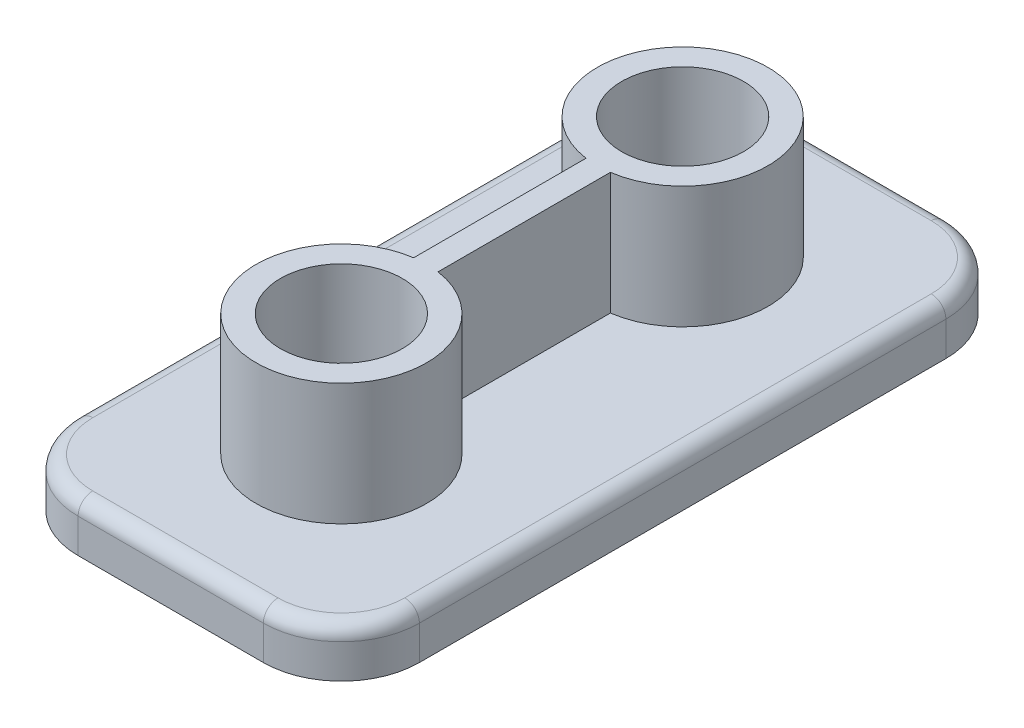
ISO-10303-21;
HEADER;
FILE_DESCRIPTION(('STEP AP214'),'2;1');
FILE_NAME('part.step','',(''),(''),'','','');
FILE_SCHEMA(('AUTOMOTIVE_DESIGN { 1 0 10303 214 1 1 1 1 }'));
ENDSEC;
DATA;
#1=APPLICATION_CONTEXT('core data for automotive mechanical design processes');
#2=APPLICATION_PROTOCOL_DEFINITION('international standard','automotive_design',2000,#1);
#3=PRODUCT_CONTEXT('',#1,'mechanical');
#4=PRODUCT('Part','Part','',(#3));
#5=PRODUCT_RELATED_PRODUCT_CATEGORY('part','',(#4));
#6=PRODUCT_DEFINITION_FORMATION('','',#4);
#7=PRODUCT_DEFINITION_CONTEXT('part definition',#1,'design');
#8=PRODUCT_DEFINITION('design','',#6,#7);
#9=PRODUCT_DEFINITION_SHAPE('','',#8);
#10=(LENGTH_UNIT() NAMED_UNIT(*) SI_UNIT(.MILLI.,.METRE.));
#11=(NAMED_UNIT(*) PLANE_ANGLE_UNIT() SI_UNIT($,.RADIAN.));
#12=(NAMED_UNIT(*) SI_UNIT($,.STERADIAN.) SOLID_ANGLE_UNIT());
#13=UNCERTAINTY_MEASURE_WITH_UNIT(LENGTH_MEASURE(1.E-05),#10,'distance_accuracy_value','');
#14=(GEOMETRIC_REPRESENTATION_CONTEXT(3) GLOBAL_UNCERTAINTY_ASSIGNED_CONTEXT((#13)) GLOBAL_UNIT_ASSIGNED_CONTEXT((#10,
#11,#12)) REPRESENTATION_CONTEXT('',''));
#15=CARTESIAN_POINT('',(0.,0.,0.));
#16=DIRECTION('',(0.,0.,1.));
#17=DIRECTION('',(1.,0.,0.));
#18=AXIS2_PLACEMENT_3D('',#15,#16,#17);
#19=CARTESIAN_POINT('',(-19.171974522293,0.,140.));
#20=DIRECTION('',(0.,-1.,0.));
#21=DIRECTION('',(0.,0.,-1.));
#22=AXIS2_PLACEMENT_3D('',#19,#20,#21);
#23=PLANE('',#22);
#24=CARTESIAN_POINT('',(34.828025477707,0.,124.));
#25=DIRECTION('',(0.,-1.,0.));
#26=DIRECTION('',(0.,0.,-1.));
#27=AXIS2_PLACEMENT_3D('',#24,#25,#26);
#28=CIRCLE('',#27,13.);
#29=CARTESIAN_POINT('',(34.828025477707,0.,137.));
#30=VERTEX_POINT('',#29);
#31=CARTESIAN_POINT('',(47.828025477707,0.,124.));
#32=VERTEX_POINT('',#31);
#33=EDGE_CURVE('E207',#30,#32,#28,.F.);
#34=ORIENTED_EDGE('',*,*,#33,.T.);
#35=DIRECTION('',(0.,0.,-1.));
#36=VECTOR('',#35,1.);
#37=CARTESIAN_POINT('',(47.828025477707,0.,140.));
#38=LINE('',#37,#36);
#39=CARTESIAN_POINT('',(47.828025477707,0.,16.));
#40=VERTEX_POINT('',#39);
#41=EDGE_CURVE('E221',#32,#40,#38,.T.);
#42=ORIENTED_EDGE('',*,*,#41,.T.);
#43=CARTESIAN_POINT('',(34.828025477707,0.,16.));
#44=DIRECTION('',(0.,-1.,0.));
#45=DIRECTION('',(0.,0.,-1.));
#46=AXIS2_PLACEMENT_3D('',#43,#44,#45);
#47=CIRCLE('',#46,13.);
#48=CARTESIAN_POINT('',(34.828025477707,0.,3.));
#49=VERTEX_POINT('',#48);
#50=EDGE_CURVE('E219',#40,#49,#47,.F.);
#51=ORIENTED_EDGE('',*,*,#50,.T.);
#52=DIRECTION('',(-1.,0.,0.));
#53=VECTOR('',#52,1.);
#54=CARTESIAN_POINT('',(-19.171974522293,0.,3.));
#55=LINE('',#54,#53);
#56=CARTESIAN_POINT('',(-3.17197452229299,0.,3.));
#57=VERTEX_POINT('',#56);
#58=EDGE_CURVE('E217',#49,#57,#55,.T.);
#59=ORIENTED_EDGE('',*,*,#58,.T.);
#60=CARTESIAN_POINT('',(-3.17197452229299,0.,16.));
#61=DIRECTION('',(0.,-1.,0.));
#62=DIRECTION('',(0.,0.,-1.));
#63=AXIS2_PLACEMENT_3D('',#60,#61,#62);
#64=CIRCLE('',#63,13.);
#65=CARTESIAN_POINT('',(-16.171974522293,0.,16.));
#66=VERTEX_POINT('',#65);
#67=EDGE_CURVE('E215',#57,#66,#64,.F.);
#68=ORIENTED_EDGE('',*,*,#67,.T.);
#69=DIRECTION('',(0.,0.,-1.));
#70=VECTOR('',#69,1.);
#71=CARTESIAN_POINT('',(-16.171974522293,0.,140.));
#72=LINE('',#71,#70);
#73=CARTESIAN_POINT('',(-16.171974522293,0.,124.));
#74=VERTEX_POINT('',#73);
#75=EDGE_CURVE('E213',#66,#74,#72,.F.);
#76=ORIENTED_EDGE('',*,*,#75,.T.);
#77=CARTESIAN_POINT('',(-3.17197452229299,0.,124.));
#78=DIRECTION('',(0.,-1.,0.));
#79=DIRECTION('',(0.,0.,-1.));
#80=AXIS2_PLACEMENT_3D('',#77,#78,#79);
#81=CIRCLE('',#80,13.);
#82=CARTESIAN_POINT('',(-3.17197452229299,0.,137.));
#83=VERTEX_POINT('',#82);
#84=EDGE_CURVE('E211',#74,#83,#81,.F.);
#85=ORIENTED_EDGE('',*,*,#84,.T.);
#86=DIRECTION('',(-1.,0.,0.));
#87=VECTOR('',#86,1.);
#88=CARTESIAN_POINT('',(34.828025477707,0.,137.));
#89=LINE('',#88,#87);
#90=EDGE_CURVE('E209',#83,#30,#89,.F.);
#91=ORIENTED_EDGE('',*,*,#90,.T.);
#92=EDGE_LOOP('',(#34,#42,#51,#59,#68,#76,#85,#91));
#93=FACE_BOUND('',#92,.T.);
#94=DIRECTION('',(0.,0.,-1.));
#95=VECTOR('',#94,1.);
#96=CARTESIAN_POINT('',(13.328025477707,0.,38.289380208763));
#97=LINE('',#96,#95);
#98=CARTESIAN_POINT('',(13.328025477707,0.,52.3205080756888));
#99=VERTEX_POINT('',#98);
#100=CARTESIAN_POINT('',(13.328025477707,0.,87.6794919243112));
#101=VERTEX_POINT('',#100);
#102=EDGE_CURVE('E158',#99,#101,#97,.F.);
#103=ORIENTED_EDGE('',*,*,#102,.F.);
#104=CARTESIAN_POINT('',(15.828025477707,0.,35.));
#105=DIRECTION('',(0.,-1.,0.));
#106=DIRECTION('',(0.,0.,-1.));
#107=AXIS2_PLACEMENT_3D('',#104,#105,#106);
#108=CIRCLE('',#107,17.5);
#109=CARTESIAN_POINT('',(18.328025477707,0.,52.3205080756888));
#110=VERTEX_POINT('',#109);
#111=EDGE_CURVE('E165',#110,#99,#108,.F.);
#112=ORIENTED_EDGE('',*,*,#111,.F.);
#113=DIRECTION('',(0.,0.,-1.));
#114=VECTOR('',#113,1.);
#115=CARTESIAN_POINT('',(18.328025477707,0.,38.289380208763));
#116=LINE('',#115,#114);
#117=CARTESIAN_POINT('',(18.328025477707,0.,87.6794919243112));
#118=VERTEX_POINT('',#117);
#119=EDGE_CURVE('E146',#110,#118,#116,.F.);
#120=ORIENTED_EDGE('',*,*,#119,.T.);
#121=CARTESIAN_POINT('',(15.828025477707,0.,105.));
#122=DIRECTION('',(0.,-1.,0.));
#123=DIRECTION('',(0.,0.,-1.));
#124=AXIS2_PLACEMENT_3D('',#121,#122,#123);
#125=CIRCLE('',#124,17.5);
#126=EDGE_CURVE('E171',#101,#118,#125,.F.);
#127=ORIENTED_EDGE('',*,*,#126,.F.);
#128=EDGE_LOOP('',(#103,#112,#120,#127));
#129=FACE_BOUND('',#128,.T.);
#130=ADVANCED_FACE('F33',(#93,#129),#23,.F.);
#131=CARTESIAN_POINT('',(15.828025477707,25.,35.));
#132=DIRECTION('',(0.,-1.,0.));
#133=DIRECTION('',(0.,0.,-1.));
#134=AXIS2_PLACEMENT_3D('',#131,#132,#133);
#135=CYLINDRICAL_SURFACE('',#134,17.5);
#136=DIRECTION('',(0.,-1.,0.));
#137=VECTOR('',#136,1.);
#138=CARTESIAN_POINT('',(13.328025477707,25.,52.3205080756888));
#139=LINE('',#138,#137);
#140=CARTESIAN_POINT('',(13.328025477707,25.,52.3205080756888));
#141=VERTEX_POINT('',#140);
#142=EDGE_CURVE('E286',#141,#99,#139,.T.);
#143=ORIENTED_EDGE('',*,*,#142,.F.);
#144=CARTESIAN_POINT('',(15.828025477707,25.,35.));
#145=DIRECTION('',(0.,1.,0.));
#146=DIRECTION('',(0.,0.,1.));
#147=AXIS2_PLACEMENT_3D('',#144,#145,#146);
#148=CIRCLE('',#147,17.5);
#149=CARTESIAN_POINT('',(18.328025477707,25.,52.3205080756888));
#150=VERTEX_POINT('',#149);
#151=EDGE_CURVE('E167',#150,#141,#148,.T.);
#152=ORIENTED_EDGE('',*,*,#151,.F.);
#153=DIRECTION('',(0.,-1.,0.));
#154=VECTOR('',#153,1.);
#155=CARTESIAN_POINT('',(18.328025477707,25.,52.3205080756888));
#156=LINE('',#155,#154);
#157=EDGE_CURVE('E149',#150,#110,#156,.T.);
#158=ORIENTED_EDGE('',*,*,#157,.T.);
#159=ORIENTED_EDGE('',*,*,#111,.T.);
#160=EDGE_LOOP('',(#143,#152,#158,#159));
#161=FACE_BOUND('',#160,.T.);
#162=ADVANCED_FACE('F164',(#161),#135,.T.);
#163=CARTESIAN_POINT('',(15.828025477707,25.,105.));
#164=DIRECTION('',(0.,-1.,0.));
#165=DIRECTION('',(0.,0.,-1.));
#166=AXIS2_PLACEMENT_3D('',#163,#164,#165);
#167=CYLINDRICAL_SURFACE('',#166,17.5);
#168=DIRECTION('',(0.,-1.,0.));
#169=VECTOR('',#168,1.);
#170=CARTESIAN_POINT('',(13.328025477707,25.,87.6794919243112));
#171=LINE('',#170,#169);
#172=CARTESIAN_POINT('',(13.328025477707,25.,87.6794919243112));
#173=VERTEX_POINT('',#172);
#174=EDGE_CURVE('E168',#101,#173,#171,.F.);
#175=ORIENTED_EDGE('',*,*,#174,.F.);
#176=ORIENTED_EDGE('',*,*,#126,.T.);
#177=DIRECTION('',(0.,-1.,0.));
#178=VECTOR('',#177,1.);
#179=CARTESIAN_POINT('',(18.328025477707,25.,87.6794919243112));
#180=LINE('',#179,#178);
#181=CARTESIAN_POINT('',(18.328025477707,25.,87.6794919243112));
#182=VERTEX_POINT('',#181);
#183=EDGE_CURVE('E152',#118,#182,#180,.F.);
#184=ORIENTED_EDGE('',*,*,#183,.T.);
#185=CARTESIAN_POINT('',(15.828025477707,25.,105.));
#186=DIRECTION('',(0.,1.,0.));
#187=DIRECTION('',(0.,0.,1.));
#188=AXIS2_PLACEMENT_3D('',#185,#186,#187);
#189=CIRCLE('',#188,17.5);
#190=EDGE_CURVE('E288',#173,#182,#189,.T.);
#191=ORIENTED_EDGE('',*,*,#190,.F.);
#192=EDGE_LOOP('',(#175,#176,#184,#191));
#193=FACE_BOUND('',#192,.T.);
#194=ADVANCED_FACE('F362',(#193),#167,.T.);
#195=CARTESIAN_POINT('',(-19.171974522293,0.,140.));
#196=DIRECTION('',(1.,0.,0.));
#197=DIRECTION('',(0.,0.,-1.));
#198=AXIS2_PLACEMENT_3D('',#195,#196,#197);
#199=PLANE('',#198);
#200=DIRECTION('',(0.,-1.,0.));
#201=VECTOR('',#200,1.);
#202=CARTESIAN_POINT('',(-19.171974522293,0.,124.));
#203=LINE('',#202,#201);
#204=CARTESIAN_POINT('',(-19.171974522293,-10.,124.));
#205=VERTEX_POINT('',#204);
#206=CARTESIAN_POINT('',(-19.171974522293,-3.,124.));
#207=VERTEX_POINT('',#206);
#208=EDGE_CURVE('E204',#205,#207,#203,.F.);
#209=ORIENTED_EDGE('',*,*,#208,.T.);
#210=DIRECTION('',(0.,0.,-1.));
#211=VECTOR('',#210,1.);
#212=CARTESIAN_POINT('',(-19.171974522293,-3.,140.));
#213=LINE('',#212,#211);
#214=CARTESIAN_POINT('',(-19.171974522293,-3.,16.));
#215=VERTEX_POINT('',#214);
#216=EDGE_CURVE('E233',#207,#215,#213,.T.);
#217=ORIENTED_EDGE('',*,*,#216,.T.);
#218=DIRECTION('',(0.,-1.,0.));
#219=VECTOR('',#218,1.);
#220=CARTESIAN_POINT('',(-19.171974522293,0.,16.));
#221=LINE('',#220,#219);
#222=CARTESIAN_POINT('',(-19.171974522293,-10.,16.));
#223=VERTEX_POINT('',#222);
#224=EDGE_CURVE('E202',#215,#223,#221,.T.);
#225=ORIENTED_EDGE('',*,*,#224,.T.);
#226=DIRECTION('',(0.,0.,-1.));
#227=VECTOR('',#226,1.);
#228=CARTESIAN_POINT('',(-19.171974522293,-10.,140.));
#229=LINE('',#228,#227);
#230=EDGE_CURVE('E172',#205,#223,#229,.T.);
#231=ORIENTED_EDGE('',*,*,#230,.F.);
#232=EDGE_LOOP('',(#209,#217,#225,#231));
#233=FACE_BOUND('',#232,.T.);
#234=ADVANCED_FACE('F329',(#233),#199,.F.);
#235=CARTESIAN_POINT('',(-19.171974522293,-10.,140.));
#236=DIRECTION('',(0.,1.,0.));
#237=DIRECTION('',(0.,0.,1.));
#238=AXIS2_PLACEMENT_3D('',#235,#236,#237);
#239=PLANE('',#238);
#240=CARTESIAN_POINT('',(15.828025477707,-10.,105.));
#241=DIRECTION('',(0.,1.,0.));
#242=DIRECTION('',(0.,0.,1.));
#243=AXIS2_PLACEMENT_3D('',#240,#241,#242);
#244=CIRCLE('',#243,12.5);
#245=CARTESIAN_POINT('',(15.828025477707,-10.,117.5));
#246=VERTEX_POINT('',#245);
#247=EDGE_CURVE('E266',#246,#246,#244,.T.);
#248=ORIENTED_EDGE('',*,*,#247,.T.);
#249=EDGE_LOOP('',(#248));
#250=FACE_BOUND('',#249,.T.);
#251=CARTESIAN_POINT('',(15.828025477707,-10.,35.0000000000001));
#252=DIRECTION('',(0.,1.,0.));
#253=DIRECTION('',(0.,0.,1.));
#254=AXIS2_PLACEMENT_3D('',#251,#252,#253);
#255=CIRCLE('',#254,12.5);
#256=CARTESIAN_POINT('',(15.828025477707,-10.,47.5000000000001));
#257=VERTEX_POINT('',#256);
#258=EDGE_CURVE('E276',#257,#257,#255,.T.);
#259=ORIENTED_EDGE('',*,*,#258,.T.);
#260=EDGE_LOOP('',(#259));
#261=FACE_BOUND('',#260,.T.);
#262=DIRECTION('',(1.,0.,0.));
#263=VECTOR('',#262,1.);
#264=CARTESIAN_POINT('',(-19.171974522293,-10.,0.));
#265=LINE('',#264,#263);
#266=CARTESIAN_POINT('',(-3.17197452229299,-10.,0.));
#267=VERTEX_POINT('',#266);
#268=CARTESIAN_POINT('',(34.828025477707,-10.,0.));
#269=VERTEX_POINT('',#268);
#270=EDGE_CURVE('E292',#267,#269,#265,.T.);
#271=ORIENTED_EDGE('',*,*,#270,.T.);
#272=CARTESIAN_POINT('',(34.828025477707,-10.,16.));
#273=DIRECTION('',(0.,1.,0.));
#274=DIRECTION('',(0.,0.,1.));
#275=AXIS2_PLACEMENT_3D('',#272,#273,#274);
#276=CIRCLE('',#275,16.);
#277=CARTESIAN_POINT('',(50.828025477707,-10.,16.));
#278=VERTEX_POINT('',#277);
#279=EDGE_CURVE('E196',#269,#278,#276,.F.);
#280=ORIENTED_EDGE('',*,*,#279,.T.);
#281=DIRECTION('',(0.,0.,-1.));
#282=VECTOR('',#281,1.);
#283=CARTESIAN_POINT('',(50.828025477707,-10.,140.));
#284=LINE('',#283,#282);
#285=CARTESIAN_POINT('',(50.828025477707,-10.,124.));
#286=VERTEX_POINT('',#285);
#287=EDGE_CURVE('E177',#286,#278,#284,.T.);
#288=ORIENTED_EDGE('',*,*,#287,.F.);
#289=CARTESIAN_POINT('',(34.828025477707,-10.,124.));
#290=DIRECTION('',(0.,1.,0.));
#291=DIRECTION('',(0.,0.,1.));
#292=AXIS2_PLACEMENT_3D('',#289,#290,#291);
#293=CIRCLE('',#292,16.);
#294=CARTESIAN_POINT('',(34.828025477707,-10.,140.));
#295=VERTEX_POINT('',#294);
#296=EDGE_CURVE('E194',#286,#295,#293,.F.);
#297=ORIENTED_EDGE('',*,*,#296,.T.);
#298=DIRECTION('',(1.,0.,0.));
#299=VECTOR('',#298,1.);
#300=CARTESIAN_POINT('',(-19.171974522293,-10.,140.));
#301=LINE('',#300,#299);
#302=CARTESIAN_POINT('',(-3.17197452229299,-10.,140.));
#303=VERTEX_POINT('',#302);
#304=EDGE_CURVE('E293',#303,#295,#301,.T.);
#305=ORIENTED_EDGE('',*,*,#304,.F.);
#306=CARTESIAN_POINT('',(-3.17197452229299,-10.,124.));
#307=DIRECTION('',(0.,1.,0.));
#308=DIRECTION('',(0.,0.,1.));
#309=AXIS2_PLACEMENT_3D('',#306,#307,#308);
#310=CIRCLE('',#309,16.);
#311=EDGE_CURVE('E192',#303,#205,#310,.F.);
#312=ORIENTED_EDGE('',*,*,#311,.T.);
#313=ORIENTED_EDGE('',*,*,#230,.T.);
#314=CARTESIAN_POINT('',(-3.17197452229299,-10.,16.));
#315=DIRECTION('',(0.,1.,0.));
#316=DIRECTION('',(0.,0.,1.));
#317=AXIS2_PLACEMENT_3D('',#314,#315,#316);
#318=CIRCLE('',#317,16.);
#319=EDGE_CURVE('E190',#223,#267,#318,.F.);
#320=ORIENTED_EDGE('',*,*,#319,.T.);
#321=EDGE_LOOP('',(#271,#280,#288,#297,#305,#312,#313,#320));
#322=FACE_BOUND('',#321,.T.);
#323=ADVANCED_FACE('F321',(#250,#261,#322),#239,.F.);
#324=CARTESIAN_POINT('',(50.828025477707,0.,140.));
#325=DIRECTION('',(-1.,0.,0.));
#326=DIRECTION('',(0.,0.,1.));
#327=AXIS2_PLACEMENT_3D('',#324,#325,#326);
#328=PLANE('',#327);
#329=DIRECTION('',(0.,1.,0.));
#330=VECTOR('',#329,1.);
#331=CARTESIAN_POINT('',(50.828025477707,0.,16.));
#332=LINE('',#331,#330);
#333=CARTESIAN_POINT('',(50.828025477707,-3.,16.));
#334=VERTEX_POINT('',#333);
#335=EDGE_CURVE('E182',#278,#334,#332,.T.);
#336=ORIENTED_EDGE('',*,*,#335,.T.);
#337=DIRECTION('',(0.,0.,-1.));
#338=VECTOR('',#337,1.);
#339=CARTESIAN_POINT('',(50.828025477707,-3.,140.));
#340=LINE('',#339,#338);
#341=CARTESIAN_POINT('',(50.828025477707,-3.,124.));
#342=VERTEX_POINT('',#341);
#343=EDGE_CURVE('E224',#334,#342,#340,.F.);
#344=ORIENTED_EDGE('',*,*,#343,.T.);
#345=DIRECTION('',(0.,1.,0.));
#346=VECTOR('',#345,1.);
#347=CARTESIAN_POINT('',(50.828025477707,-10.,124.));
#348=LINE('',#347,#346);
#349=EDGE_CURVE('E174',#342,#286,#348,.F.);
#350=ORIENTED_EDGE('',*,*,#349,.T.);
#351=ORIENTED_EDGE('',*,*,#287,.T.);
#352=EDGE_LOOP('',(#336,#344,#350,#351));
#353=FACE_BOUND('',#352,.T.);
#354=ADVANCED_FACE('F301',(#353),#328,.F.);
#355=CARTESIAN_POINT('',(0.,0.,140.));
#356=DIRECTION('',(0.,0.,1.));
#357=DIRECTION('',(1.,0.,0.));
#358=AXIS2_PLACEMENT_3D('',#355,#356,#357);
#359=PLANE('',#358);
#360=DIRECTION('',(0.,1.,0.));
#361=VECTOR('',#360,1.);
#362=CARTESIAN_POINT('',(34.828025477707,0.,140.));
#363=LINE('',#362,#361);
#364=CARTESIAN_POINT('',(34.828025477707,-3.,140.));
#365=VERTEX_POINT('',#364);
#366=EDGE_CURVE('E200',#295,#365,#363,.T.);
#367=ORIENTED_EDGE('',*,*,#366,.T.);
#368=DIRECTION('',(-1.,0.,0.));
#369=VECTOR('',#368,1.);
#370=CARTESIAN_POINT('',(-3.17197452229299,-3.,140.));
#371=LINE('',#370,#369);
#372=CARTESIAN_POINT('',(-3.17197452229299,-3.,140.));
#373=VERTEX_POINT('',#372);
#374=EDGE_CURVE('E42',#365,#373,#371,.T.);
#375=ORIENTED_EDGE('',*,*,#374,.T.);
#376=DIRECTION('',(0.,-1.,0.));
#377=VECTOR('',#376,1.);
#378=CARTESIAN_POINT('',(-3.17197452229299,-10.,140.));
#379=LINE('',#378,#377);
#380=EDGE_CURVE('E198',#373,#303,#379,.T.);
#381=ORIENTED_EDGE('',*,*,#380,.T.);
#382=ORIENTED_EDGE('',*,*,#304,.T.);
#383=EDGE_LOOP('',(#367,#375,#381,#382));
#384=FACE_BOUND('',#383,.T.);
#385=ADVANCED_FACE('F322',(#384),#359,.T.);
#386=CARTESIAN_POINT('',(0.,0.,0.));
#387=DIRECTION('',(0.,0.,1.));
#388=DIRECTION('',(1.,0.,0.));
#389=AXIS2_PLACEMENT_3D('',#386,#387,#388);
#390=PLANE('',#389);
#391=DIRECTION('',(0.,-1.,0.));
#392=VECTOR('',#391,1.);
#393=CARTESIAN_POINT('',(-3.17197452229299,0.,0.));
#394=LINE('',#393,#392);
#395=CARTESIAN_POINT('',(-3.17197452229299,-3.,0.));
#396=VERTEX_POINT('',#395);
#397=EDGE_CURVE('E185',#267,#396,#394,.F.);
#398=ORIENTED_EDGE('',*,*,#397,.T.);
#399=DIRECTION('',(-1.,0.,0.));
#400=VECTOR('',#399,1.);
#401=CARTESIAN_POINT('',(0.,-3.,0.));
#402=LINE('',#401,#400);
#403=CARTESIAN_POINT('',(34.828025477707,-3.,0.));
#404=VERTEX_POINT('',#403);
#405=EDGE_CURVE('E229',#396,#404,#402,.F.);
#406=ORIENTED_EDGE('',*,*,#405,.T.);
#407=DIRECTION('',(0.,1.,0.));
#408=VECTOR('',#407,1.);
#409=CARTESIAN_POINT('',(34.828025477707,0.,0.));
#410=LINE('',#409,#408);
#411=EDGE_CURVE('E188',#404,#269,#410,.F.);
#412=ORIENTED_EDGE('',*,*,#411,.T.);
#413=ORIENTED_EDGE('',*,*,#270,.F.);
#414=EDGE_LOOP('',(#398,#406,#412,#413));
#415=FACE_BOUND('',#414,.T.);
#416=ADVANCED_FACE('F338',(#415),#390,.F.);
#417=CARTESIAN_POINT('',(15.828025477707,25.,35.));
#418=DIRECTION('',(0.,1.,0.));
#419=DIRECTION('',(0.,0.,1.));
#420=AXIS2_PLACEMENT_3D('',#417,#418,#419);
#421=PLANE('',#420);
#422=CARTESIAN_POINT('',(15.828025477707,25.,105.));
#423=DIRECTION('',(0.,1.,0.));
#424=DIRECTION('',(0.,0.,1.));
#425=AXIS2_PLACEMENT_3D('',#422,#423,#424);
#426=CIRCLE('',#425,12.5);
#427=CARTESIAN_POINT('',(15.828025477707,25.,117.5));
#428=VERTEX_POINT('',#427);
#429=EDGE_CURVE('E260',#428,#428,#426,.T.);
#430=ORIENTED_EDGE('',*,*,#429,.F.);
#431=EDGE_LOOP('',(#430));
#432=FACE_BOUND('',#431,.T.);
#433=CARTESIAN_POINT('',(15.828025477707,25.,35.0000000000001));
#434=DIRECTION('',(0.,1.,0.));
#435=DIRECTION('',(0.,0.,1.));
#436=AXIS2_PLACEMENT_3D('',#433,#434,#435);
#437=CIRCLE('',#436,12.5);
#438=CARTESIAN_POINT('',(15.828025477707,25.,47.5000000000001));
#439=VERTEX_POINT('',#438);
#440=EDGE_CURVE('E271',#439,#439,#437,.T.);
#441=ORIENTED_EDGE('',*,*,#440,.F.);
#442=EDGE_LOOP('',(#441));
#443=FACE_BOUND('',#442,.T.);
#444=ORIENTED_EDGE('',*,*,#151,.T.);
#445=DIRECTION('',(0.,0.,-1.));
#446=VECTOR('',#445,1.);
#447=CARTESIAN_POINT('',(13.328025477707,25.,38.289380208763));
#448=LINE('',#447,#446);
#449=EDGE_CURVE('E157',#141,#173,#448,.F.);
#450=ORIENTED_EDGE('',*,*,#449,.T.);
#451=ORIENTED_EDGE('',*,*,#190,.T.);
#452=DIRECTION('',(0.,0.,-1.));
#453=VECTOR('',#452,1.);
#454=CARTESIAN_POINT('',(18.328025477707,25.,38.289380208763));
#455=LINE('',#454,#453);
#456=EDGE_CURVE('E280',#150,#182,#455,.F.);
#457=ORIENTED_EDGE('',*,*,#456,.F.);
#458=EDGE_LOOP('',(#444,#450,#451,#457));
#459=FACE_BOUND('',#458,.T.);
#460=ADVANCED_FACE('F491',(#432,#443,#459),#421,.T.);
#461=CARTESIAN_POINT('',(13.328025477707,25.,38.289380208763));
#462=DIRECTION('',(1.,0.,0.));
#463=DIRECTION('',(0.,0.,-1.));
#464=AXIS2_PLACEMENT_3D('',#461,#462,#463);
#465=PLANE('',#464);
#466=ORIENTED_EDGE('',*,*,#449,.F.);
#467=ORIENTED_EDGE('',*,*,#142,.T.);
#468=ORIENTED_EDGE('',*,*,#102,.T.);
#469=ORIENTED_EDGE('',*,*,#174,.T.);
#470=EDGE_LOOP('',(#466,#467,#468,#469));
#471=FACE_BOUND('',#470,.T.);
#472=ADVANCED_FACE('F483',(#471),#465,.F.);
#473=CARTESIAN_POINT('',(18.328025477707,25.,38.289380208763));
#474=DIRECTION('',(1.,0.,0.));
#475=DIRECTION('',(0.,0.,-1.));
#476=AXIS2_PLACEMENT_3D('',#473,#474,#475);
#477=PLANE('',#476);
#478=ORIENTED_EDGE('',*,*,#157,.F.);
#479=ORIENTED_EDGE('',*,*,#456,.T.);
#480=ORIENTED_EDGE('',*,*,#183,.F.);
#481=ORIENTED_EDGE('',*,*,#119,.F.);
#482=EDGE_LOOP('',(#478,#479,#480,#481));
#483=FACE_BOUND('',#482,.T.);
#484=ADVANCED_FACE('F148',(#483),#477,.T.);
#485=CARTESIAN_POINT('',(15.828025477707,-69.,35.0000000000001));
#486=DIRECTION('',(0.,1.,0.));
#487=DIRECTION('',(0.,0.,1.));
#488=AXIS2_PLACEMENT_3D('',#485,#486,#487);
#489=CYLINDRICAL_SURFACE('',#488,12.5);
#490=ORIENTED_EDGE('',*,*,#440,.T.);
#491=EDGE_LOOP('',(#490));
#492=FACE_BOUND('',#491,.T.);
#493=ORIENTED_EDGE('',*,*,#258,.F.);
#494=EDGE_LOOP('',(#493));
#495=FACE_BOUND('',#494,.T.);
#496=ADVANCED_FACE('F465',(#492,#495),#489,.F.);
#497=CARTESIAN_POINT('',(15.828025477707,-69.,105.));
#498=DIRECTION('',(0.,1.,0.));
#499=DIRECTION('',(0.,0.,1.));
#500=AXIS2_PLACEMENT_3D('',#497,#498,#499);
#501=CYLINDRICAL_SURFACE('',#500,12.5);
#502=ORIENTED_EDGE('',*,*,#429,.T.);
#503=EDGE_LOOP('',(#502));
#504=FACE_BOUND('',#503,.T.);
#505=ORIENTED_EDGE('',*,*,#247,.F.);
#506=EDGE_LOOP('',(#505));
#507=FACE_BOUND('',#506,.T.);
#508=ADVANCED_FACE('F376',(#504,#507),#501,.F.);
#509=CARTESIAN_POINT('',(34.828025477707,0.,16.));
#510=DIRECTION('',(0.,1.,0.));
#511=DIRECTION('',(0.,0.,1.));
#512=AXIS2_PLACEMENT_3D('',#509,#510,#511);
#513=CYLINDRICAL_SURFACE('',#512,16.);
#514=ORIENTED_EDGE('',*,*,#411,.F.);
#515=CARTESIAN_POINT('',(34.828025477707,-3.,16.));
#516=DIRECTION('',(0.,-1.,0.));
#517=DIRECTION('',(0.,0.,-1.));
#518=AXIS2_PLACEMENT_3D('',#515,#516,#517);
#519=CIRCLE('',#518,16.);
#520=EDGE_CURVE('E227',#404,#334,#519,.T.);
#521=ORIENTED_EDGE('',*,*,#520,.T.);
#522=ORIENTED_EDGE('',*,*,#335,.F.);
#523=ORIENTED_EDGE('',*,*,#279,.F.);
#524=EDGE_LOOP('',(#514,#521,#522,#523));
#525=FACE_BOUND('',#524,.T.);
#526=ADVANCED_FACE('F308',(#525),#513,.T.);
#527=CARTESIAN_POINT('',(34.828025477707,0.,124.));
#528=DIRECTION('',(0.,-1.,0.));
#529=DIRECTION('',(0.,0.,-1.));
#530=AXIS2_PLACEMENT_3D('',#527,#528,#529);
#531=CYLINDRICAL_SURFACE('',#530,16.);
#532=ORIENTED_EDGE('',*,*,#349,.F.);
#533=CARTESIAN_POINT('',(34.828025477707,-3.,124.));
#534=DIRECTION('',(0.,-1.,0.));
#535=DIRECTION('',(0.,0.,-1.));
#536=AXIS2_PLACEMENT_3D('',#533,#534,#535);
#537=CIRCLE('',#536,16.);
#538=EDGE_CURVE('E11',#342,#365,#537,.T.);
#539=ORIENTED_EDGE('',*,*,#538,.T.);
#540=ORIENTED_EDGE('',*,*,#366,.F.);
#541=ORIENTED_EDGE('',*,*,#296,.F.);
#542=EDGE_LOOP('',(#532,#539,#540,#541));
#543=FACE_BOUND('',#542,.T.);
#544=ADVANCED_FACE('F319',(#543),#531,.T.);
#545=CARTESIAN_POINT('',(-3.17197452229299,0.,124.));
#546=DIRECTION('',(0.,1.,0.));
#547=DIRECTION('',(0.,0.,1.));
#548=AXIS2_PLACEMENT_3D('',#545,#546,#547);
#549=CYLINDRICAL_SURFACE('',#548,16.);
#550=ORIENTED_EDGE('',*,*,#380,.F.);
#551=CARTESIAN_POINT('',(-3.17197452229299,-3.,124.));
#552=DIRECTION('',(0.,-1.,0.));
#553=DIRECTION('',(0.,0.,-1.));
#554=AXIS2_PLACEMENT_3D('',#551,#552,#553);
#555=CIRCLE('',#554,16.);
#556=EDGE_CURVE('E235',#373,#207,#555,.T.);
#557=ORIENTED_EDGE('',*,*,#556,.T.);
#558=ORIENTED_EDGE('',*,*,#208,.F.);
#559=ORIENTED_EDGE('',*,*,#311,.F.);
#560=EDGE_LOOP('',(#550,#557,#558,#559));
#561=FACE_BOUND('',#560,.T.);
#562=ADVANCED_FACE('F326',(#561),#549,.T.);
#563=CARTESIAN_POINT('',(-3.17197452229299,0.,16.));
#564=DIRECTION('',(0.,-1.,0.));
#565=DIRECTION('',(0.,0.,-1.));
#566=AXIS2_PLACEMENT_3D('',#563,#564,#565);
#567=CYLINDRICAL_SURFACE('',#566,16.);
#568=ORIENTED_EDGE('',*,*,#224,.F.);
#569=CARTESIAN_POINT('',(-3.17197452229299,-3.,16.));
#570=DIRECTION('',(0.,-1.,0.));
#571=DIRECTION('',(0.,0.,-1.));
#572=AXIS2_PLACEMENT_3D('',#569,#570,#571);
#573=CIRCLE('',#572,16.);
#574=EDGE_CURVE('E231',#215,#396,#573,.T.);
#575=ORIENTED_EDGE('',*,*,#574,.T.);
#576=ORIENTED_EDGE('',*,*,#397,.F.);
#577=ORIENTED_EDGE('',*,*,#319,.F.);
#578=EDGE_LOOP('',(#568,#575,#576,#577));
#579=FACE_BOUND('',#578,.T.);
#580=ADVANCED_FACE('F335',(#579),#567,.T.);
#581=CARTESIAN_POINT('',(-16.171974522293,-3.,140.));
#582=DIRECTION('',(0.,0.,-1.));
#583=DIRECTION('',(-1.,0.,0.));
#584=AXIS2_PLACEMENT_3D('',#581,#582,#583);
#585=CYLINDRICAL_SURFACE('',#584,3.);
#586=CARTESIAN_POINT('',(-16.171974522293,-3.,16.));
#587=DIRECTION('',(0.,0.,-1.));
#588=DIRECTION('',(-1.,0.,0.));
#589=AXIS2_PLACEMENT_3D('',#586,#587,#588);
#590=CIRCLE('',#589,3.);
#591=EDGE_CURVE('E253',#215,#66,#590,.T.);
#592=ORIENTED_EDGE('',*,*,#591,.F.);
#593=ORIENTED_EDGE('',*,*,#216,.F.);
#594=CARTESIAN_POINT('',(-16.171974522293,-3.,124.));
#595=DIRECTION('',(0.,0.,1.));
#596=DIRECTION('',(1.,0.,0.));
#597=AXIS2_PLACEMENT_3D('',#594,#595,#596);
#598=CIRCLE('',#597,3.);
#599=EDGE_CURVE('E37',#74,#207,#598,.T.);
#600=ORIENTED_EDGE('',*,*,#599,.F.);
#601=ORIENTED_EDGE('',*,*,#75,.F.);
#602=EDGE_LOOP('',(#592,#593,#600,#601));
#603=FACE_BOUND('',#602,.T.);
#604=ADVANCED_FACE('F35',(#603),#585,.T.);
#605=CARTESIAN_POINT('',(-3.17197452229299,-3.,124.));
#606=DIRECTION('',(0.,-1.,0.));
#607=DIRECTION('',(0.,0.,-1.));
#608=AXIS2_PLACEMENT_3D('',#605,#606,#607);
#609=TOROIDAL_SURFACE('',#608,13.,3.);
#610=ORIENTED_EDGE('',*,*,#599,.T.);
#611=ORIENTED_EDGE('',*,*,#556,.F.);
#612=CARTESIAN_POINT('',(-3.17197452229299,-3.,137.));
#613=DIRECTION('',(1.,0.,0.));
#614=DIRECTION('',(0.,0.,-1.));
#615=AXIS2_PLACEMENT_3D('',#612,#613,#614);
#616=CIRCLE('',#615,3.);
#617=EDGE_CURVE('E251',#83,#373,#616,.T.);
#618=ORIENTED_EDGE('',*,*,#617,.F.);
#619=ORIENTED_EDGE('',*,*,#84,.F.);
#620=EDGE_LOOP('',(#610,#611,#618,#619));
#621=FACE_BOUND('',#620,.T.);
#622=ADVANCED_FACE('F349',(#621),#609,.T.);
#623=CARTESIAN_POINT('',(-3.17197452229299,-3.,16.));
#624=DIRECTION('',(0.,-1.,0.));
#625=DIRECTION('',(0.,0.,-1.));
#626=AXIS2_PLACEMENT_3D('',#623,#624,#625);
#627=TOROIDAL_SURFACE('',#626,13.,3.);
#628=ORIENTED_EDGE('',*,*,#591,.T.);
#629=ORIENTED_EDGE('',*,*,#67,.F.);
#630=CARTESIAN_POINT('',(-3.17197452229299,-3.,3.));
#631=DIRECTION('',(1.,0.,0.));
#632=DIRECTION('',(0.,0.,-1.));
#633=AXIS2_PLACEMENT_3D('',#630,#631,#632);
#634=CIRCLE('',#633,3.);
#635=EDGE_CURVE('E248',#396,#57,#634,.T.);
#636=ORIENTED_EDGE('',*,*,#635,.F.);
#637=ORIENTED_EDGE('',*,*,#574,.F.);
#638=EDGE_LOOP('',(#628,#629,#636,#637));
#639=FACE_BOUND('',#638,.T.);
#640=ADVANCED_FACE('F346',(#639),#627,.T.);
#641=CARTESIAN_POINT('',(0.,-3.,137.));
#642=DIRECTION('',(1.,0.,0.));
#643=DIRECTION('',(0.,0.,-1.));
#644=AXIS2_PLACEMENT_3D('',#641,#642,#643);
#645=CYLINDRICAL_SURFACE('',#644,3.);
#646=ORIENTED_EDGE('',*,*,#617,.T.);
#647=ORIENTED_EDGE('',*,*,#374,.F.);
#648=CARTESIAN_POINT('',(34.828025477707,-3.,137.));
#649=DIRECTION('',(1.,0.,0.));
#650=DIRECTION('',(0.,0.,-1.));
#651=AXIS2_PLACEMENT_3D('',#648,#649,#650);
#652=CIRCLE('',#651,3.);
#653=EDGE_CURVE('E245',#30,#365,#652,.T.);
#654=ORIENTED_EDGE('',*,*,#653,.F.);
#655=ORIENTED_EDGE('',*,*,#90,.F.);
#656=EDGE_LOOP('',(#646,#647,#654,#655));
#657=FACE_BOUND('',#656,.T.);
#658=ADVANCED_FACE('F348',(#657),#645,.T.);
#659=CARTESIAN_POINT('',(-19.171974522293,-3.,3.));
#660=DIRECTION('',(-1.,0.,0.));
#661=DIRECTION('',(0.,0.,1.));
#662=AXIS2_PLACEMENT_3D('',#659,#660,#661);
#663=CYLINDRICAL_SURFACE('',#662,3.);
#664=ORIENTED_EDGE('',*,*,#635,.T.);
#665=ORIENTED_EDGE('',*,*,#58,.F.);
#666=CARTESIAN_POINT('',(34.828025477707,-3.,3.));
#667=DIRECTION('',(1.,0.,0.));
#668=DIRECTION('',(0.,0.,-1.));
#669=AXIS2_PLACEMENT_3D('',#666,#667,#668);
#670=CIRCLE('',#669,3.);
#671=EDGE_CURVE('E242',#404,#49,#670,.T.);
#672=ORIENTED_EDGE('',*,*,#671,.F.);
#673=ORIENTED_EDGE('',*,*,#405,.F.);
#674=EDGE_LOOP('',(#664,#665,#672,#673));
#675=FACE_BOUND('',#674,.T.);
#676=ADVANCED_FACE('F342',(#675),#663,.T.);
#677=CARTESIAN_POINT('',(34.828025477707,-3.,124.));
#678=DIRECTION('',(0.,-1.,0.));
#679=DIRECTION('',(0.,0.,-1.));
#680=AXIS2_PLACEMENT_3D('',#677,#678,#679);
#681=TOROIDAL_SURFACE('',#680,13.,3.);
#682=ORIENTED_EDGE('',*,*,#653,.T.);
#683=ORIENTED_EDGE('',*,*,#538,.F.);
#684=CARTESIAN_POINT('',(47.828025477707,-3.,124.));
#685=DIRECTION('',(0.,0.,-1.));
#686=DIRECTION('',(-1.,0.,0.));
#687=AXIS2_PLACEMENT_3D('',#684,#685,#686);
#688=CIRCLE('',#687,3.);
#689=EDGE_CURVE('E240',#32,#342,#688,.T.);
#690=ORIENTED_EDGE('',*,*,#689,.F.);
#691=ORIENTED_EDGE('',*,*,#33,.F.);
#692=EDGE_LOOP('',(#682,#683,#690,#691));
#693=FACE_BOUND('',#692,.T.);
#694=ADVANCED_FACE('F387',(#693),#681,.T.);
#695=CARTESIAN_POINT('',(34.828025477707,-3.,16.));
#696=DIRECTION('',(0.,-1.,0.));
#697=DIRECTION('',(0.,0.,-1.));
#698=AXIS2_PLACEMENT_3D('',#695,#696,#697);
#699=TOROIDAL_SURFACE('',#698,13.,3.);
#700=ORIENTED_EDGE('',*,*,#671,.T.);
#701=ORIENTED_EDGE('',*,*,#50,.F.);
#702=CARTESIAN_POINT('',(47.828025477707,-3.,16.));
#703=DIRECTION('',(0.,0.,1.));
#704=DIRECTION('',(1.,0.,0.));
#705=AXIS2_PLACEMENT_3D('',#702,#703,#704);
#706=CIRCLE('',#705,3.);
#707=EDGE_CURVE('E238',#334,#40,#706,.T.);
#708=ORIENTED_EDGE('',*,*,#707,.F.);
#709=ORIENTED_EDGE('',*,*,#520,.F.);
#710=EDGE_LOOP('',(#700,#701,#708,#709));
#711=FACE_BOUND('',#710,.T.);
#712=ADVANCED_FACE('F313',(#711),#699,.T.);
#713=CARTESIAN_POINT('',(47.828025477707,-3.,140.));
#714=DIRECTION('',(0.,0.,-1.));
#715=DIRECTION('',(-1.,0.,0.));
#716=AXIS2_PLACEMENT_3D('',#713,#714,#715);
#717=CYLINDRICAL_SURFACE('',#716,3.);
#718=ORIENTED_EDGE('',*,*,#689,.T.);
#719=ORIENTED_EDGE('',*,*,#343,.F.);
#720=ORIENTED_EDGE('',*,*,#707,.T.);
#721=ORIENTED_EDGE('',*,*,#41,.F.);
#722=EDGE_LOOP('',(#718,#719,#720,#721));
#723=FACE_BOUND('',#722,.T.);
#724=ADVANCED_FACE('F317',(#723),#717,.T.);
#725=CLOSED_SHELL('',(#130,#162,#194,#234,#323,#354,#385,#416,#460,#472,#484,#496,#508,#526,
#544,#562,#580,#604,#622,#640,#658,#676,#694,#712,#724));
#726=MANIFOLD_SOLID_BREP('B2',#725);
#727=ADVANCED_BREP_SHAPE_REPRESENTATION('',(#18,#726),#14);
#728=SHAPE_DEFINITION_REPRESENTATION(#9,#727);
ENDSEC;
END-ISO-10303-21;
